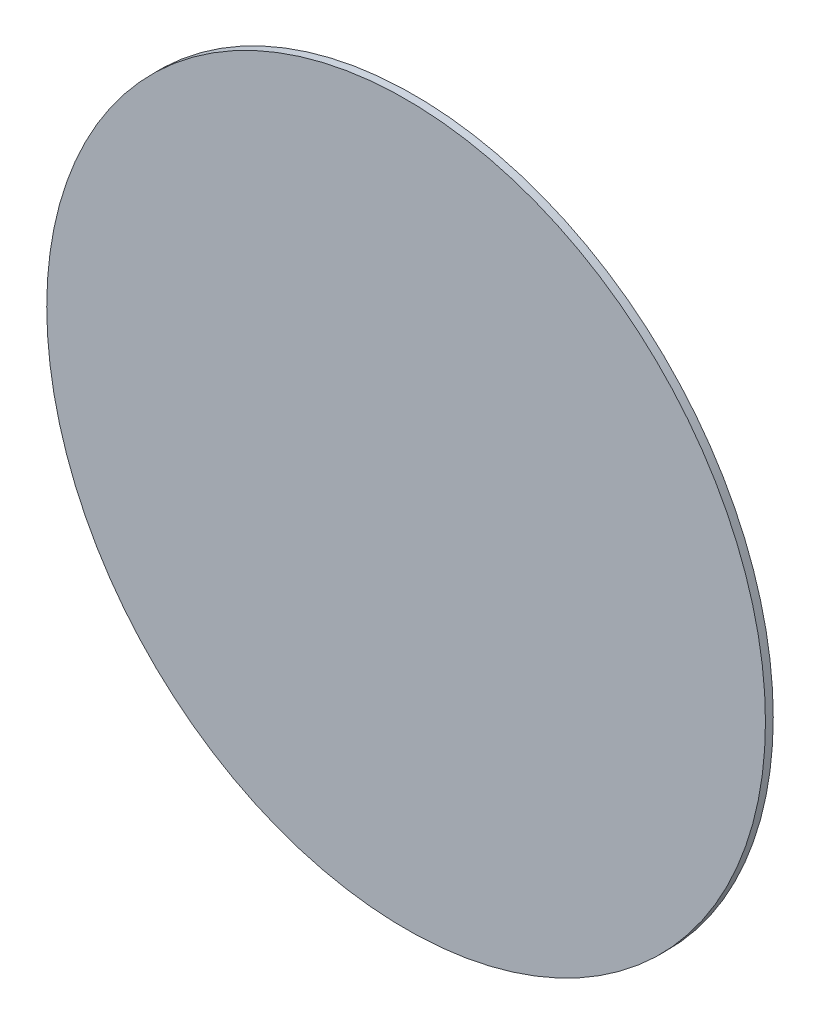
ISO-10303-21;
HEADER;
FILE_DESCRIPTION(('STEP AP214'),'2;1');
FILE_NAME('part.step','',(''),(''),'','','');
FILE_SCHEMA(('AUTOMOTIVE_DESIGN { 1 0 10303 214 1 1 1 1 }'));
ENDSEC;
DATA;
#1=APPLICATION_CONTEXT('core data for automotive mechanical design processes');
#2=APPLICATION_PROTOCOL_DEFINITION('international standard','automotive_design',2000,#1);
#3=PRODUCT_CONTEXT('',#1,'mechanical');
#4=PRODUCT('Part','Part','',(#3));
#5=PRODUCT_RELATED_PRODUCT_CATEGORY('part','',(#4));
#6=PRODUCT_DEFINITION_FORMATION('','',#4);
#7=PRODUCT_DEFINITION_CONTEXT('part definition',#1,'design');
#8=PRODUCT_DEFINITION('design','',#6,#7);
#9=PRODUCT_DEFINITION_SHAPE('','',#8);
#10=(LENGTH_UNIT() NAMED_UNIT(*) SI_UNIT(.MILLI.,.METRE.));
#11=(NAMED_UNIT(*) PLANE_ANGLE_UNIT() SI_UNIT($,.RADIAN.));
#12=(NAMED_UNIT(*) SI_UNIT($,.STERADIAN.) SOLID_ANGLE_UNIT());
#13=UNCERTAINTY_MEASURE_WITH_UNIT(LENGTH_MEASURE(1.E-05),#10,'distance_accuracy_value','');
#14=(GEOMETRIC_REPRESENTATION_CONTEXT(3) GLOBAL_UNCERTAINTY_ASSIGNED_CONTEXT((#13)) GLOBAL_UNIT_ASSIGNED_CONTEXT((#10,
#11,#12)) REPRESENTATION_CONTEXT('',''));
#15=CARTESIAN_POINT('',(0.,0.,0.));
#16=DIRECTION('',(0.,0.,1.));
#17=DIRECTION('',(1.,0.,0.));
#18=AXIS2_PLACEMENT_3D('',#15,#16,#17);
#19=CARTESIAN_POINT('',(0.,0.,1.));
#20=DIRECTION('',(0.,0.,-1.));
#21=DIRECTION('',(-1.,0.,0.));
#22=AXIS2_PLACEMENT_3D('',#19,#20,#21);
#23=CYLINDRICAL_SURFACE('',#22,46.);
#24=CARTESIAN_POINT('',(0.,0.,1.));
#25=DIRECTION('',(0.,0.,1.));
#26=DIRECTION('',(1.,0.,0.));
#27=AXIS2_PLACEMENT_3D('',#24,#25,#26);
#28=CIRCLE('',#27,46.);
#29=CARTESIAN_POINT('',(46.,0.,1.));
#30=VERTEX_POINT('',#29);
#31=EDGE_CURVE('E10',#30,#30,#28,.T.);
#32=ORIENTED_EDGE('',*,*,#31,.F.);
#33=EDGE_LOOP('',(#32));
#34=FACE_BOUND('',#33,.T.);
#35=CARTESIAN_POINT('',(0.,0.,0.));
#36=DIRECTION('',(0.,0.,1.));
#37=DIRECTION('',(1.,0.,0.));
#38=AXIS2_PLACEMENT_3D('',#35,#36,#37);
#39=CIRCLE('',#38,46.);
#40=CARTESIAN_POINT('',(46.,0.,0.));
#41=VERTEX_POINT('',#40);
#42=EDGE_CURVE('E39',#41,#41,#39,.T.);
#43=ORIENTED_EDGE('',*,*,#42,.T.);
#44=EDGE_LOOP('',(#43));
#45=FACE_BOUND('',#44,.T.);
#46=ADVANCED_FACE('F36',(#34,#45),#23,.T.);
#47=CARTESIAN_POINT('',(0.,0.,1.));
#48=DIRECTION('',(0.,0.,1.));
#49=DIRECTION('',(1.,0.,0.));
#50=AXIS2_PLACEMENT_3D('',#47,#48,#49);
#51=PLANE('',#50);
#52=ORIENTED_EDGE('',*,*,#31,.T.);
#53=EDGE_LOOP('',(#52));
#54=FACE_BOUND('',#53,.T.);
#55=ADVANCED_FACE('F51',(#54),#51,.T.);
#56=CARTESIAN_POINT('',(0.,0.,0.));
#57=DIRECTION('',(0.,0.,1.));
#58=DIRECTION('',(1.,0.,0.));
#59=AXIS2_PLACEMENT_3D('',#56,#57,#58);
#60=PLANE('',#59);
#61=ORIENTED_EDGE('',*,*,#42,.F.);
#62=EDGE_LOOP('',(#61));
#63=FACE_BOUND('',#62,.T.);
#64=ADVANCED_FACE('F49',(#63),#60,.F.);
#65=CLOSED_SHELL('',(#46,#55,#64));
#66=MANIFOLD_SOLID_BREP('B2',#65);
#67=ADVANCED_BREP_SHAPE_REPRESENTATION('',(#18,#66),#14);
#68=SHAPE_DEFINITION_REPRESENTATION(#9,#67);
ENDSEC;
END-ISO-10303-21;
